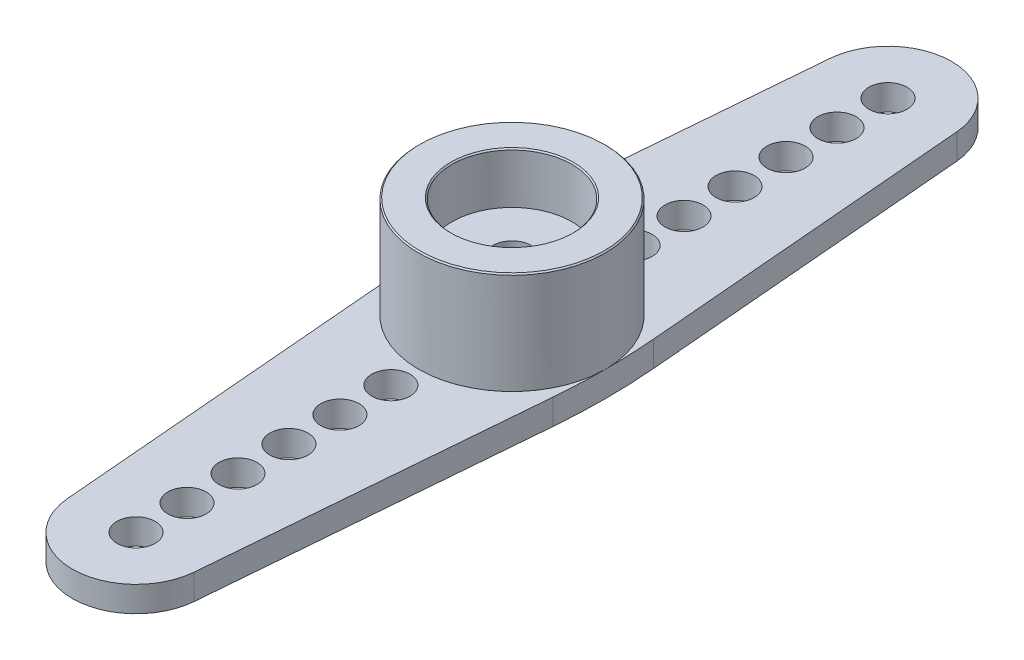
ISO-10303-21;
HEADER;
FILE_DESCRIPTION(('STEP AP214'),'2;1');
FILE_NAME('part.step','',(''),(''),'','','');
FILE_SCHEMA(('AUTOMOTIVE_DESIGN { 1 0 10303 214 1 1 1 1 }'));
ENDSEC;
DATA;
#1=APPLICATION_CONTEXT('core data for automotive mechanical design processes');
#2=APPLICATION_PROTOCOL_DEFINITION('international standard','automotive_design',2000,#1);
#3=PRODUCT_CONTEXT('',#1,'mechanical');
#4=PRODUCT('Part','Part','',(#3));
#5=PRODUCT_RELATED_PRODUCT_CATEGORY('part','',(#4));
#6=PRODUCT_DEFINITION_FORMATION('','',#4);
#7=PRODUCT_DEFINITION_CONTEXT('part definition',#1,'design');
#8=PRODUCT_DEFINITION('design','',#6,#7);
#9=PRODUCT_DEFINITION_SHAPE('','',#8);
#10=(LENGTH_UNIT() NAMED_UNIT(*) SI_UNIT(.MILLI.,.METRE.));
#11=(NAMED_UNIT(*) PLANE_ANGLE_UNIT() SI_UNIT($,.RADIAN.));
#12=(NAMED_UNIT(*) SI_UNIT($,.STERADIAN.) SOLID_ANGLE_UNIT());
#13=UNCERTAINTY_MEASURE_WITH_UNIT(LENGTH_MEASURE(1.E-05),#10,'distance_accuracy_value','');
#14=(GEOMETRIC_REPRESENTATION_CONTEXT(3) GLOBAL_UNCERTAINTY_ASSIGNED_CONTEXT((#13)) GLOBAL_UNIT_ASSIGNED_CONTEXT((#10,
#11,#12)) REPRESENTATION_CONTEXT('',''));
#15=CARTESIAN_POINT('',(0.,0.,0.));
#16=DIRECTION('',(0.,0.,1.));
#17=DIRECTION('',(1.,0.,0.));
#18=AXIS2_PLACEMENT_3D('',#15,#16,#17);
#19=CARTESIAN_POINT('',(0.,1.,0.));
#20=DIRECTION('',(0.,-1.,0.));
#21=DIRECTION('',(0.,0.,-1.));
#22=AXIS2_PLACEMENT_3D('',#19,#20,#21);
#23=CYLINDRICAL_SURFACE('',#22,0.75);
#24=CARTESIAN_POINT('',(0.,0.5,0.));
#25=DIRECTION('',(0.,-1.,0.));
#26=DIRECTION('',(0.,0.,-1.));
#27=AXIS2_PLACEMENT_3D('',#24,#25,#26);
#28=CIRCLE('',#27,0.75);
#29=CARTESIAN_POINT('',(0.,0.5,-0.75));
#30=VERTEX_POINT('',#29);
#31=EDGE_CURVE('E180',#30,#30,#28,.T.);
#32=ORIENTED_EDGE('',*,*,#31,.T.);
#33=EDGE_LOOP('',(#32));
#34=FACE_BOUND('',#33,.T.);
#35=CARTESIAN_POINT('',(0.,3.,0.));
#36=DIRECTION('',(0.,1.,0.));
#37=DIRECTION('',(0.,0.,1.));
#38=AXIS2_PLACEMENT_3D('',#35,#36,#37);
#39=CIRCLE('',#38,0.75);
#40=CARTESIAN_POINT('',(0.,3.,0.75));
#41=VERTEX_POINT('',#40);
#42=EDGE_CURVE('E185',#41,#41,#39,.T.);
#43=ORIENTED_EDGE('',*,*,#42,.T.);
#44=EDGE_LOOP('',(#43));
#45=FACE_BOUND('',#44,.T.);
#46=ADVANCED_FACE('F36',(#34,#45),#23,.F.);
#47=CARTESIAN_POINT('',(0.,1.,-14.75));
#48=DIRECTION('',(0.,-1.,0.));
#49=DIRECTION('',(0.,0.,-1.));
#50=AXIS2_PLACEMENT_3D('',#47,#48,#49);
#51=PLANE('',#50);
#52=CARTESIAN_POINT('',(1.39659253553725E-13,1.,4.75));
#53=DIRECTION('',(0.,1.,0.));
#54=DIRECTION('',(0.,0.,-1.));
#55=AXIS2_PLACEMENT_3D('',#52,#53,#54);
#56=CIRCLE('',#55,0.75);
#57=CARTESIAN_POINT('',(1.39659253553725E-13,1.,4.));
#58=VERTEX_POINT('',#57);
#59=EDGE_CURVE('E376',#58,#58,#56,.T.);
#60=ORIENTED_EDGE('',*,*,#59,.F.);
#61=EDGE_LOOP('',(#60));
#62=FACE_BOUND('',#61,.T.);
#63=CARTESIAN_POINT('',(0.,1.,6.75));
#64=DIRECTION('',(0.,1.,0.));
#65=DIRECTION('',(0.,0.,-1.));
#66=AXIS2_PLACEMENT_3D('',#63,#64,#65);
#67=CIRCLE('',#66,0.75);
#68=CARTESIAN_POINT('',(0.,1.,6.));
#69=VERTEX_POINT('',#68);
#70=EDGE_CURVE('E370',#69,#69,#67,.T.);
#71=ORIENTED_EDGE('',*,*,#70,.F.);
#72=EDGE_LOOP('',(#71));
#73=FACE_BOUND('',#72,.T.);
#74=CARTESIAN_POINT('',(0.,1.,8.75));
#75=DIRECTION('',(0.,1.,0.));
#76=DIRECTION('',(0.,0.,-1.));
#77=AXIS2_PLACEMENT_3D('',#74,#75,#76);
#78=CIRCLE('',#77,0.75);
#79=CARTESIAN_POINT('',(0.,1.,8.));
#80=VERTEX_POINT('',#79);
#81=EDGE_CURVE('E364',#80,#80,#78,.T.);
#82=ORIENTED_EDGE('',*,*,#81,.F.);
#83=EDGE_LOOP('',(#82));
#84=FACE_BOUND('',#83,.T.);
#85=CARTESIAN_POINT('',(0.,1.,10.75));
#86=DIRECTION('',(0.,1.,0.));
#87=DIRECTION('',(0.,0.,-1.));
#88=AXIS2_PLACEMENT_3D('',#85,#86,#87);
#89=CIRCLE('',#88,0.75);
#90=CARTESIAN_POINT('',(0.,1.,10.));
#91=VERTEX_POINT('',#90);
#92=EDGE_CURVE('E358',#91,#91,#89,.T.);
#93=ORIENTED_EDGE('',*,*,#92,.F.);
#94=EDGE_LOOP('',(#93));
#95=FACE_BOUND('',#94,.T.);
#96=CARTESIAN_POINT('',(0.,1.,12.75));
#97=DIRECTION('',(0.,1.,0.));
#98=DIRECTION('',(0.,0.,-1.));
#99=AXIS2_PLACEMENT_3D('',#96,#97,#98);
#100=CIRCLE('',#99,0.75000000000002);
#101=CARTESIAN_POINT('',(0.,1.,12.));
#102=VERTEX_POINT('',#101);
#103=EDGE_CURVE('E352',#102,#102,#100,.T.);
#104=ORIENTED_EDGE('',*,*,#103,.F.);
#105=EDGE_LOOP('',(#104));
#106=FACE_BOUND('',#105,.T.);
#107=CARTESIAN_POINT('',(0.,1.,14.75));
#108=DIRECTION('',(0.,1.,0.));
#109=DIRECTION('',(0.,0.,-1.));
#110=AXIS2_PLACEMENT_3D('',#107,#108,#109);
#111=CIRCLE('',#110,0.75);
#112=CARTESIAN_POINT('',(0.,1.,14.));
#113=VERTEX_POINT('',#112);
#114=EDGE_CURVE('E346',#113,#113,#111,.T.);
#115=ORIENTED_EDGE('',*,*,#114,.F.);
#116=EDGE_LOOP('',(#115));
#117=FACE_BOUND('',#116,.T.);
#118=CARTESIAN_POINT('',(-19.8360523248812,1.,0.));
#119=DIRECTION('',(0.,1.,0.));
#120=DIRECTION('',(0.,0.,1.));
#121=AXIS2_PLACEMENT_3D('',#118,#119,#120);
#122=CIRCLE('',#121,23.5029905467121);
#123=CARTESIAN_POINT('',(3.58416895802137,1.,1.97073582671904));
#124=VERTEX_POINT('',#123);
#125=CARTESIAN_POINT('',(3.66693822183086,1.,0.));
#126=VERTEX_POINT('',#125);
#127=EDGE_CURVE('E122',#124,#126,#122,.T.);
#128=ORIENTED_EDGE('',*,*,#127,.T.);
#129=CARTESIAN_POINT('',(0.,1.,0.));
#130=DIRECTION('',(0.,-1.,0.));
#131=DIRECTION('',(0.,0.,-1.));
#132=AXIS2_PLACEMENT_3D('',#129,#130,#131);
#133=CIRCLE('',#132,3.66693822183086);
#134=CARTESIAN_POINT('',(-3.66693822183086,1.,0.));
#135=VERTEX_POINT('',#134);
#136=EDGE_CURVE('E51',#126,#135,#133,.T.);
#137=ORIENTED_EDGE('',*,*,#136,.T.);
#138=CARTESIAN_POINT('',(19.8360523248812,1.,0.));
#139=DIRECTION('',(0.,1.,0.));
#140=DIRECTION('',(0.,0.,1.));
#141=AXIS2_PLACEMENT_3D('',#138,#139,#140);
#142=CIRCLE('',#141,23.5029905467121);
#143=CARTESIAN_POINT('',(-3.58416895802137,1.,1.97073582671905));
#144=VERTEX_POINT('',#143);
#145=EDGE_CURVE('E306',#135,#144,#142,.T.);
#146=ORIENTED_EDGE('',*,*,#145,.T.);
#147=DIRECTION('',(0.0838504284296131,0.,0.996478351823144));
#148=VECTOR('',#147,1.);
#149=CARTESIAN_POINT('',(-3.58416895802137,1.,1.97073582671904));
#150=LINE('',#149,#148);
#151=CARTESIAN_POINT('',(-2.49119587955786,1.,14.959626071074));
#152=VERTEX_POINT('',#151);
#153=EDGE_CURVE('E307',#144,#152,#150,.T.);
#154=ORIENTED_EDGE('',*,*,#153,.T.);
#155=CARTESIAN_POINT('',(0.,1.,14.75));
#156=DIRECTION('',(0.,1.,0.));
#157=DIRECTION('',(0.,0.,1.));
#158=AXIS2_PLACEMENT_3D('',#155,#156,#157);
#159=CIRCLE('',#158,2.5);
#160=CARTESIAN_POINT('',(2.49119587955786,1.,14.959626071074));
#161=VERTEX_POINT('',#160);
#162=EDGE_CURVE('E124',#152,#161,#159,.T.);
#163=ORIENTED_EDGE('',*,*,#162,.T.);
#164=DIRECTION('',(0.0838504284296132,0.,-0.996478351823144));
#165=VECTOR('',#164,1.);
#166=CARTESIAN_POINT('',(3.58416895802137,1.,1.97073582671904));
#167=LINE('',#166,#165);
#168=EDGE_CURVE('E118',#161,#124,#167,.T.);
#169=ORIENTED_EDGE('',*,*,#168,.T.);
#170=EDGE_LOOP('',(#128,#137,#146,#154,#163,#169));
#171=FACE_BOUND('',#170,.T.);
#172=ADVANCED_FACE('F120',(#62,#73,#84,#95,#106,#117,#171),#51,.F.);
#173=CARTESIAN_POINT('',(-3.58416895802137,1.,-1.97073582671904));
#174=VERTEX_POINT('',#173);
#175=EDGE_CURVE('E305',#174,#135,#142,.T.);
#176=ORIENTED_EDGE('',*,*,#175,.T.);
#177=EDGE_CURVE('E183',#135,#126,#133,.T.);
#178=ORIENTED_EDGE('',*,*,#177,.T.);
#179=CARTESIAN_POINT('',(3.58416895802137,1.,-1.97073582671904));
#180=VERTEX_POINT('',#179);
#181=EDGE_CURVE('E128',#126,#180,#122,.T.);
#182=ORIENTED_EDGE('',*,*,#181,.T.);
#183=DIRECTION('',(-0.0838504284296132,0.,-0.996478351823144));
#184=VECTOR('',#183,1.);
#185=CARTESIAN_POINT('',(2.49119587955786,1.,-14.959626071074));
#186=LINE('',#185,#184);
#187=CARTESIAN_POINT('',(2.49119587955786,1.,-14.959626071074));
#188=VERTEX_POINT('',#187);
#189=EDGE_CURVE('E60',#180,#188,#186,.T.);
#190=ORIENTED_EDGE('',*,*,#189,.T.);
#191=CARTESIAN_POINT('',(0.,1.,-14.75));
#192=DIRECTION('',(0.,1.,0.));
#193=DIRECTION('',(0.,0.,-1.));
#194=AXIS2_PLACEMENT_3D('',#191,#192,#193);
#195=CIRCLE('',#194,2.5);
#196=CARTESIAN_POINT('',(-2.49119587955786,1.,-14.959626071074));
#197=VERTEX_POINT('',#196);
#198=EDGE_CURVE('E164',#188,#197,#195,.T.);
#199=ORIENTED_EDGE('',*,*,#198,.T.);
#200=DIRECTION('',(-0.0838504284296131,0.,0.996478351823144));
#201=VECTOR('',#200,1.);
#202=CARTESIAN_POINT('',(-2.49119587955786,1.,-14.959626071074));
#203=LINE('',#202,#201);
#204=EDGE_CURVE('E102',#197,#174,#203,.T.);
#205=ORIENTED_EDGE('',*,*,#204,.T.);
#206=EDGE_LOOP('',(#176,#178,#182,#190,#199,#205));
#207=FACE_BOUND('',#206,.T.);
#208=CARTESIAN_POINT('',(0.,1.,-14.75));
#209=DIRECTION('',(0.,1.,0.));
#210=DIRECTION('',(0.,0.,1.));
#211=AXIS2_PLACEMENT_3D('',#208,#209,#210);
#212=CIRCLE('',#211,0.75);
#213=CARTESIAN_POINT('',(0.,1.,-14.));
#214=VERTEX_POINT('',#213);
#215=EDGE_CURVE('E152',#214,#214,#212,.T.);
#216=ORIENTED_EDGE('',*,*,#215,.F.);
#217=EDGE_LOOP('',(#216));
#218=FACE_BOUND('',#217,.T.);
#219=CARTESIAN_POINT('',(0.,1.,-12.75));
#220=DIRECTION('',(0.,1.,0.));
#221=DIRECTION('',(0.,0.,1.));
#222=AXIS2_PLACEMENT_3D('',#219,#220,#221);
#223=CIRCLE('',#222,0.75000000000002);
#224=CARTESIAN_POINT('',(0.,1.,-12.));
#225=VERTEX_POINT('',#224);
#226=EDGE_CURVE('E316',#225,#225,#223,.T.);
#227=ORIENTED_EDGE('',*,*,#226,.F.);
#228=EDGE_LOOP('',(#227));
#229=FACE_BOUND('',#228,.T.);
#230=CARTESIAN_POINT('',(0.,1.,-10.75));
#231=DIRECTION('',(0.,1.,0.));
#232=DIRECTION('',(0.,0.,1.));
#233=AXIS2_PLACEMENT_3D('',#230,#231,#232);
#234=CIRCLE('',#233,0.75);
#235=CARTESIAN_POINT('',(0.,1.,-10.));
#236=VERTEX_POINT('',#235);
#237=EDGE_CURVE('E322',#236,#236,#234,.T.);
#238=ORIENTED_EDGE('',*,*,#237,.F.);
#239=EDGE_LOOP('',(#238));
#240=FACE_BOUND('',#239,.T.);
#241=CARTESIAN_POINT('',(0.,1.,-8.75));
#242=DIRECTION('',(0.,1.,0.));
#243=DIRECTION('',(0.,0.,1.));
#244=AXIS2_PLACEMENT_3D('',#241,#242,#243);
#245=CIRCLE('',#244,0.75);
#246=CARTESIAN_POINT('',(0.,1.,-8.));
#247=VERTEX_POINT('',#246);
#248=EDGE_CURVE('E328',#247,#247,#245,.T.);
#249=ORIENTED_EDGE('',*,*,#248,.F.);
#250=EDGE_LOOP('',(#249));
#251=FACE_BOUND('',#250,.T.);
#252=CARTESIAN_POINT('',(0.,1.,-6.75));
#253=DIRECTION('',(0.,1.,0.));
#254=DIRECTION('',(0.,0.,1.));
#255=AXIS2_PLACEMENT_3D('',#252,#253,#254);
#256=CIRCLE('',#255,0.75);
#257=CARTESIAN_POINT('',(0.,1.,-6.));
#258=VERTEX_POINT('',#257);
#259=EDGE_CURVE('E334',#258,#258,#256,.T.);
#260=ORIENTED_EDGE('',*,*,#259,.F.);
#261=EDGE_LOOP('',(#260));
#262=FACE_BOUND('',#261,.T.);
#263=CARTESIAN_POINT('',(1.39659253553725E-13,1.,-4.75));
#264=DIRECTION('',(0.,1.,0.));
#265=DIRECTION('',(0.,0.,1.));
#266=AXIS2_PLACEMENT_3D('',#263,#264,#265);
#267=CIRCLE('',#266,0.75);
#268=CARTESIAN_POINT('',(1.39659253553725E-13,1.,-4.));
#269=VERTEX_POINT('',#268);
#270=EDGE_CURVE('E340',#269,#269,#267,.T.);
#271=ORIENTED_EDGE('',*,*,#270,.F.);
#272=EDGE_LOOP('',(#271));
#273=FACE_BOUND('',#272,.T.);
#274=ADVANCED_FACE('F225',(#207,#218,#229,#240,#251,#262,#273),#51,.F.);
#275=CARTESIAN_POINT('',(0.,0.,-14.75));
#276=DIRECTION('',(0.,-1.,0.));
#277=DIRECTION('',(0.,0.,-1.));
#278=AXIS2_PLACEMENT_3D('',#275,#276,#277);
#279=PLANE('',#278);
#280=CARTESIAN_POINT('',(0.,0.,0.));
#281=DIRECTION('',(0.,-1.,0.));
#282=DIRECTION('',(0.,0.,-1.));
#283=AXIS2_PLACEMENT_3D('',#280,#281,#282);
#284=CIRCLE('',#283,1.5);
#285=CARTESIAN_POINT('',(0.,0.,-1.5));
#286=VERTEX_POINT('',#285);
#287=EDGE_CURVE('E188',#286,#286,#284,.T.);
#288=ORIENTED_EDGE('',*,*,#287,.F.);
#289=EDGE_LOOP('',(#288));
#290=FACE_BOUND('',#289,.T.);
#291=DIRECTION('',(-0.0838504284296132,0.,-0.996478351823144));
#292=VECTOR('',#291,1.);
#293=CARTESIAN_POINT('',(2.49119587955786,0.,-14.959626071074));
#294=LINE('',#293,#292);
#295=CARTESIAN_POINT('',(3.58416895802137,0.,-1.97073582671904));
#296=VERTEX_POINT('',#295);
#297=CARTESIAN_POINT('',(2.49119587955786,0.,-14.959626071074));
#298=VERTEX_POINT('',#297);
#299=EDGE_CURVE('E93',#296,#298,#294,.T.);
#300=ORIENTED_EDGE('',*,*,#299,.F.);
#301=CARTESIAN_POINT('',(-19.8360523248812,0.,0.));
#302=DIRECTION('',(0.,1.,0.));
#303=DIRECTION('',(0.,0.,1.));
#304=AXIS2_PLACEMENT_3D('',#301,#302,#303);
#305=CIRCLE('',#304,23.5029905467121);
#306=CARTESIAN_POINT('',(3.58416895802137,0.,1.97073582671904));
#307=VERTEX_POINT('',#306);
#308=EDGE_CURVE('E161',#307,#296,#305,.T.);
#309=ORIENTED_EDGE('',*,*,#308,.F.);
#310=DIRECTION('',(0.0838504284296132,0.,-0.996478351823144));
#311=VECTOR('',#310,1.);
#312=CARTESIAN_POINT('',(3.58416895802137,0.,1.97073582671904));
#313=LINE('',#312,#311);
#314=CARTESIAN_POINT('',(2.49119587955786,0.,14.959626071074));
#315=VERTEX_POINT('',#314);
#316=EDGE_CURVE('E134',#315,#307,#313,.T.);
#317=ORIENTED_EDGE('',*,*,#316,.F.);
#318=CARTESIAN_POINT('',(0.,0.,14.75));
#319=DIRECTION('',(0.,1.,0.));
#320=DIRECTION('',(0.,0.,1.));
#321=AXIS2_PLACEMENT_3D('',#318,#319,#320);
#322=CIRCLE('',#321,2.5);
#323=CARTESIAN_POINT('',(-2.49119587955786,0.,14.959626071074));
#324=VERTEX_POINT('',#323);
#325=EDGE_CURVE('E158',#324,#315,#322,.T.);
#326=ORIENTED_EDGE('',*,*,#325,.F.);
#327=DIRECTION('',(0.0838504284296131,0.,0.996478351823144));
#328=VECTOR('',#327,1.);
#329=CARTESIAN_POINT('',(-3.58416895802137,0.,1.97073582671904));
#330=LINE('',#329,#328);
#331=CARTESIAN_POINT('',(-3.58416895802137,0.,1.97073582671905));
#332=VERTEX_POINT('',#331);
#333=EDGE_CURVE('E156',#332,#324,#330,.T.);
#334=ORIENTED_EDGE('',*,*,#333,.F.);
#335=CARTESIAN_POINT('',(19.8360523248812,0.,0.));
#336=DIRECTION('',(0.,1.,0.));
#337=DIRECTION('',(0.,0.,1.));
#338=AXIS2_PLACEMENT_3D('',#335,#336,#337);
#339=CIRCLE('',#338,23.5029905467121);
#340=CARTESIAN_POINT('',(-3.58416895802137,0.,-1.97073582671904));
#341=VERTEX_POINT('',#340);
#342=EDGE_CURVE('E154',#341,#332,#339,.T.);
#343=ORIENTED_EDGE('',*,*,#342,.F.);
#344=DIRECTION('',(-0.0838504284296131,0.,0.996478351823144));
#345=VECTOR('',#344,1.);
#346=CARTESIAN_POINT('',(-2.49119587955786,0.,-14.959626071074));
#347=LINE('',#346,#345);
#348=CARTESIAN_POINT('',(-2.49119587955786,0.,-14.959626071074));
#349=VERTEX_POINT('',#348);
#350=EDGE_CURVE('E151',#349,#341,#347,.T.);
#351=ORIENTED_EDGE('',*,*,#350,.F.);
#352=CARTESIAN_POINT('',(0.,0.,-14.75));
#353=DIRECTION('',(0.,1.,0.));
#354=DIRECTION('',(0.,0.,-1.));
#355=AXIS2_PLACEMENT_3D('',#352,#353,#354);
#356=CIRCLE('',#355,2.5);
#357=EDGE_CURVE('E148',#298,#349,#356,.T.);
#358=ORIENTED_EDGE('',*,*,#357,.F.);
#359=EDGE_LOOP('',(#300,#309,#317,#326,#334,#343,#351,#358));
#360=FACE_BOUND('',#359,.T.);
#361=CARTESIAN_POINT('',(1.39659253553725E-13,0.,-4.75));
#362=DIRECTION('',(0.,1.,0.));
#363=DIRECTION('',(0.,0.,1.));
#364=AXIS2_PLACEMENT_3D('',#361,#362,#363);
#365=CIRCLE('',#364,0.75);
#366=CARTESIAN_POINT('',(1.39659253553725E-13,0.,-4.));
#367=VERTEX_POINT('',#366);
#368=EDGE_CURVE('E343',#367,#367,#365,.T.);
#369=ORIENTED_EDGE('',*,*,#368,.T.);
#370=EDGE_LOOP('',(#369));
#371=FACE_BOUND('',#370,.T.);
#372=CARTESIAN_POINT('',(0.,0.,-8.75));
#373=DIRECTION('',(0.,1.,0.));
#374=DIRECTION('',(0.,0.,1.));
#375=AXIS2_PLACEMENT_3D('',#372,#373,#374);
#376=CIRCLE('',#375,0.75);
#377=CARTESIAN_POINT('',(0.,0.,-8.));
#378=VERTEX_POINT('',#377);
#379=EDGE_CURVE('E331',#378,#378,#376,.T.);
#380=ORIENTED_EDGE('',*,*,#379,.T.);
#381=EDGE_LOOP('',(#380));
#382=FACE_BOUND('',#381,.T.);
#383=CARTESIAN_POINT('',(0.,0.,-12.75));
#384=DIRECTION('',(0.,1.,0.));
#385=DIRECTION('',(0.,0.,1.));
#386=AXIS2_PLACEMENT_3D('',#383,#384,#385);
#387=CIRCLE('',#386,0.75000000000002);
#388=CARTESIAN_POINT('',(0.,0.,-12.));
#389=VERTEX_POINT('',#388);
#390=EDGE_CURVE('E319',#389,#389,#387,.T.);
#391=ORIENTED_EDGE('',*,*,#390,.T.);
#392=EDGE_LOOP('',(#391));
#393=FACE_BOUND('',#392,.T.);
#394=CARTESIAN_POINT('',(0.,0.,-14.75));
#395=DIRECTION('',(0.,1.,0.));
#396=DIRECTION('',(0.,0.,1.));
#397=AXIS2_PLACEMENT_3D('',#394,#395,#396);
#398=CIRCLE('',#397,0.75);
#399=CARTESIAN_POINT('',(0.,0.,-14.));
#400=VERTEX_POINT('',#399);
#401=EDGE_CURVE('E313',#400,#400,#398,.T.);
#402=ORIENTED_EDGE('',*,*,#401,.T.);
#403=EDGE_LOOP('',(#402));
#404=FACE_BOUND('',#403,.T.);
#405=CARTESIAN_POINT('',(0.,0.,-10.75));
#406=DIRECTION('',(0.,1.,0.));
#407=DIRECTION('',(0.,0.,1.));
#408=AXIS2_PLACEMENT_3D('',#405,#406,#407);
#409=CIRCLE('',#408,0.75);
#410=CARTESIAN_POINT('',(0.,0.,-10.));
#411=VERTEX_POINT('',#410);
#412=EDGE_CURVE('E325',#411,#411,#409,.T.);
#413=ORIENTED_EDGE('',*,*,#412,.T.);
#414=EDGE_LOOP('',(#413));
#415=FACE_BOUND('',#414,.T.);
#416=CARTESIAN_POINT('',(0.,0.,-6.75));
#417=DIRECTION('',(0.,1.,0.));
#418=DIRECTION('',(0.,0.,1.));
#419=AXIS2_PLACEMENT_3D('',#416,#417,#418);
#420=CIRCLE('',#419,0.75);
#421=CARTESIAN_POINT('',(0.,0.,-6.));
#422=VERTEX_POINT('',#421);
#423=EDGE_CURVE('E337',#422,#422,#420,.T.);
#424=ORIENTED_EDGE('',*,*,#423,.T.);
#425=EDGE_LOOP('',(#424));
#426=FACE_BOUND('',#425,.T.);
#427=CARTESIAN_POINT('',(1.39659253553725E-13,0.,4.75));
#428=DIRECTION('',(0.,1.,0.));
#429=DIRECTION('',(0.,0.,-1.));
#430=AXIS2_PLACEMENT_3D('',#427,#428,#429);
#431=CIRCLE('',#430,0.75);
#432=CARTESIAN_POINT('',(1.39659253553725E-13,0.,4.));
#433=VERTEX_POINT('',#432);
#434=EDGE_CURVE('E379',#433,#433,#431,.T.);
#435=ORIENTED_EDGE('',*,*,#434,.T.);
#436=EDGE_LOOP('',(#435));
#437=FACE_BOUND('',#436,.T.);
#438=CARTESIAN_POINT('',(0.,0.,8.75));
#439=DIRECTION('',(0.,1.,0.));
#440=DIRECTION('',(0.,0.,-1.));
#441=AXIS2_PLACEMENT_3D('',#438,#439,#440);
#442=CIRCLE('',#441,0.75);
#443=CARTESIAN_POINT('',(0.,0.,8.));
#444=VERTEX_POINT('',#443);
#445=EDGE_CURVE('E367',#444,#444,#442,.T.);
#446=ORIENTED_EDGE('',*,*,#445,.T.);
#447=EDGE_LOOP('',(#446));
#448=FACE_BOUND('',#447,.T.);
#449=CARTESIAN_POINT('',(0.,0.,12.75));
#450=DIRECTION('',(0.,1.,0.));
#451=DIRECTION('',(0.,0.,-1.));
#452=AXIS2_PLACEMENT_3D('',#449,#450,#451);
#453=CIRCLE('',#452,0.75000000000002);
#454=CARTESIAN_POINT('',(0.,0.,12.));
#455=VERTEX_POINT('',#454);
#456=EDGE_CURVE('E355',#455,#455,#453,.T.);
#457=ORIENTED_EDGE('',*,*,#456,.T.);
#458=EDGE_LOOP('',(#457));
#459=FACE_BOUND('',#458,.T.);
#460=CARTESIAN_POINT('',(0.,0.,14.75));
#461=DIRECTION('',(0.,1.,0.));
#462=DIRECTION('',(0.,0.,-1.));
#463=AXIS2_PLACEMENT_3D('',#460,#461,#462);
#464=CIRCLE('',#463,0.75);
#465=CARTESIAN_POINT('',(0.,0.,14.));
#466=VERTEX_POINT('',#465);
#467=EDGE_CURVE('E349',#466,#466,#464,.T.);
#468=ORIENTED_EDGE('',*,*,#467,.T.);
#469=EDGE_LOOP('',(#468));
#470=FACE_BOUND('',#469,.T.);
#471=CARTESIAN_POINT('',(0.,0.,10.75));
#472=DIRECTION('',(0.,1.,0.));
#473=DIRECTION('',(0.,0.,-1.));
#474=AXIS2_PLACEMENT_3D('',#471,#472,#473);
#475=CIRCLE('',#474,0.75);
#476=CARTESIAN_POINT('',(0.,0.,10.));
#477=VERTEX_POINT('',#476);
#478=EDGE_CURVE('E361',#477,#477,#475,.T.);
#479=ORIENTED_EDGE('',*,*,#478,.T.);
#480=EDGE_LOOP('',(#479));
#481=FACE_BOUND('',#480,.T.);
#482=CARTESIAN_POINT('',(0.,0.,6.75));
#483=DIRECTION('',(0.,1.,0.));
#484=DIRECTION('',(0.,0.,-1.));
#485=AXIS2_PLACEMENT_3D('',#482,#483,#484);
#486=CIRCLE('',#485,0.75);
#487=CARTESIAN_POINT('',(0.,0.,6.));
#488=VERTEX_POINT('',#487);
#489=EDGE_CURVE('E373',#488,#488,#486,.T.);
#490=ORIENTED_EDGE('',*,*,#489,.T.);
#491=EDGE_LOOP('',(#490));
#492=FACE_BOUND('',#491,.T.);
#493=ADVANCED_FACE('F259',(#290,#360,#371,#382,#393,#404,#415,#426,#437,#448,#459,#470,#481,
#492),#279,.T.);
#494=CARTESIAN_POINT('',(0.,1.,-14.75));
#495=DIRECTION('',(0.,-1.,0.));
#496=DIRECTION('',(0.,0.,-1.));
#497=AXIS2_PLACEMENT_3D('',#494,#495,#496);
#498=CYLINDRICAL_SURFACE('',#497,2.5);
#499=ORIENTED_EDGE('',*,*,#357,.T.);
#500=DIRECTION('',(0.,-1.,0.));
#501=VECTOR('',#500,1.);
#502=CARTESIAN_POINT('',(-2.49119587955786,1.,-14.959626071074));
#503=LINE('',#502,#501);
#504=EDGE_CURVE('E177',#197,#349,#503,.T.);
#505=ORIENTED_EDGE('',*,*,#504,.F.);
#506=ORIENTED_EDGE('',*,*,#198,.F.);
#507=DIRECTION('',(0.,-1.,0.));
#508=VECTOR('',#507,1.);
#509=CARTESIAN_POINT('',(2.49119587955786,1.,-14.959626071074));
#510=LINE('',#509,#508);
#511=EDGE_CURVE('E144',#188,#298,#510,.T.);
#512=ORIENTED_EDGE('',*,*,#511,.T.);
#513=EDGE_LOOP('',(#499,#505,#506,#512));
#514=FACE_BOUND('',#513,.T.);
#515=ADVANCED_FACE('F262',(#514),#498,.T.);
#516=CARTESIAN_POINT('',(-2.49119587955786,1.,-14.959626071074));
#517=DIRECTION('',(0.996478351823144,0.,0.0838504284296132));
#518=DIRECTION('',(0.0838504284296132,0.,-0.996478351823144));
#519=AXIS2_PLACEMENT_3D('',#516,#517,#518);
#520=PLANE('',#519);
#521=ORIENTED_EDGE('',*,*,#350,.T.);
#522=DIRECTION('',(0.,-1.,0.));
#523=VECTOR('',#522,1.);
#524=CARTESIAN_POINT('',(-3.58416895802137,1.,-1.97073582671904));
#525=LINE('',#524,#523);
#526=EDGE_CURVE('E174',#174,#341,#525,.T.);
#527=ORIENTED_EDGE('',*,*,#526,.F.);
#528=ORIENTED_EDGE('',*,*,#204,.F.);
#529=ORIENTED_EDGE('',*,*,#504,.T.);
#530=EDGE_LOOP('',(#521,#527,#528,#529));
#531=FACE_BOUND('',#530,.T.);
#532=ADVANCED_FACE('F281',(#531),#520,.F.);
#533=CARTESIAN_POINT('',(19.8360523248812,1.,0.));
#534=DIRECTION('',(0.,-1.,0.));
#535=DIRECTION('',(0.,0.,-1.));
#536=AXIS2_PLACEMENT_3D('',#533,#534,#535);
#537=CYLINDRICAL_SURFACE('',#536,23.5029905467121);
#538=ORIENTED_EDGE('',*,*,#145,.F.);
#539=ORIENTED_EDGE('',*,*,#175,.F.);
#540=ORIENTED_EDGE('',*,*,#526,.T.);
#541=ORIENTED_EDGE('',*,*,#342,.T.);
#542=DIRECTION('',(0.,-1.,0.));
#543=VECTOR('',#542,1.);
#544=CARTESIAN_POINT('',(-3.58416895802137,1.,1.97073582671905));
#545=LINE('',#544,#543);
#546=EDGE_CURVE('E171',#144,#332,#545,.T.);
#547=ORIENTED_EDGE('',*,*,#546,.F.);
#548=EDGE_LOOP('',(#538,#539,#540,#541,#547));
#549=FACE_BOUND('',#548,.T.);
#550=ADVANCED_FACE('F277',(#549),#537,.T.);
#551=CARTESIAN_POINT('',(-3.58416895802137,1.,1.97073582671904));
#552=DIRECTION('',(0.996478351823144,0.,-0.0838504284296132));
#553=DIRECTION('',(-0.0838504284296132,0.,-0.996478351823144));
#554=AXIS2_PLACEMENT_3D('',#551,#552,#553);
#555=PLANE('',#554);
#556=ORIENTED_EDGE('',*,*,#333,.T.);
#557=DIRECTION('',(0.,-1.,0.));
#558=VECTOR('',#557,1.);
#559=CARTESIAN_POINT('',(-2.49119587955786,1.,14.959626071074));
#560=LINE('',#559,#558);
#561=EDGE_CURVE('E168',#152,#324,#560,.T.);
#562=ORIENTED_EDGE('',*,*,#561,.F.);
#563=ORIENTED_EDGE('',*,*,#153,.F.);
#564=ORIENTED_EDGE('',*,*,#546,.T.);
#565=EDGE_LOOP('',(#556,#562,#563,#564));
#566=FACE_BOUND('',#565,.T.);
#567=ADVANCED_FACE('F273',(#566),#555,.F.);
#568=CARTESIAN_POINT('',(0.,1.,14.75));
#569=DIRECTION('',(0.,-1.,0.));
#570=DIRECTION('',(0.,0.,-1.));
#571=AXIS2_PLACEMENT_3D('',#568,#569,#570);
#572=CYLINDRICAL_SURFACE('',#571,2.5);
#573=ORIENTED_EDGE('',*,*,#325,.T.);
#574=DIRECTION('',(0.,-1.,0.));
#575=VECTOR('',#574,1.);
#576=CARTESIAN_POINT('',(2.49119587955786,1.,14.959626071074));
#577=LINE('',#576,#575);
#578=EDGE_CURVE('E137',#161,#315,#577,.T.);
#579=ORIENTED_EDGE('',*,*,#578,.F.);
#580=ORIENTED_EDGE('',*,*,#162,.F.);
#581=ORIENTED_EDGE('',*,*,#561,.T.);
#582=EDGE_LOOP('',(#573,#579,#580,#581));
#583=FACE_BOUND('',#582,.T.);
#584=ADVANCED_FACE('F270',(#583),#572,.T.);
#585=CARTESIAN_POINT('',(3.58416895802137,1.,1.97073582671904));
#586=DIRECTION('',(-0.996478351823144,0.,-0.0838504284296132));
#587=DIRECTION('',(-0.0838504284296132,0.,0.996478351823144));
#588=AXIS2_PLACEMENT_3D('',#585,#586,#587);
#589=PLANE('',#588);
#590=ORIENTED_EDGE('',*,*,#316,.T.);
#591=DIRECTION('',(0.,-1.,0.));
#592=VECTOR('',#591,1.);
#593=CARTESIAN_POINT('',(3.58416895802137,1.,1.97073582671904));
#594=LINE('',#593,#592);
#595=EDGE_CURVE('E131',#124,#307,#594,.T.);
#596=ORIENTED_EDGE('',*,*,#595,.F.);
#597=ORIENTED_EDGE('',*,*,#168,.F.);
#598=ORIENTED_EDGE('',*,*,#578,.T.);
#599=EDGE_LOOP('',(#590,#596,#597,#598));
#600=FACE_BOUND('',#599,.T.);
#601=ADVANCED_FACE('F132',(#600),#589,.F.);
#602=CARTESIAN_POINT('',(-19.8360523248812,1.,0.));
#603=DIRECTION('',(0.,-1.,0.));
#604=DIRECTION('',(0.,0.,-1.));
#605=AXIS2_PLACEMENT_3D('',#602,#603,#604);
#606=CYLINDRICAL_SURFACE('',#605,23.5029905467121);
#607=ORIENTED_EDGE('',*,*,#181,.F.);
#608=ORIENTED_EDGE('',*,*,#127,.F.);
#609=ORIENTED_EDGE('',*,*,#595,.T.);
#610=ORIENTED_EDGE('',*,*,#308,.T.);
#611=DIRECTION('',(0.,-1.,0.));
#612=VECTOR('',#611,1.);
#613=CARTESIAN_POINT('',(3.58416895802137,1.,-1.97073582671904));
#614=LINE('',#613,#612);
#615=EDGE_CURVE('E138',#180,#296,#614,.T.);
#616=ORIENTED_EDGE('',*,*,#615,.F.);
#617=EDGE_LOOP('',(#607,#608,#609,#610,#616));
#618=FACE_BOUND('',#617,.T.);
#619=ADVANCED_FACE('F141',(#618),#606,.T.);
#620=CARTESIAN_POINT('',(2.49119587955786,1.,-14.959626071074));
#621=DIRECTION('',(-0.996478351823144,0.,0.0838504284296132));
#622=DIRECTION('',(0.0838504284296132,0.,0.996478351823144));
#623=AXIS2_PLACEMENT_3D('',#620,#621,#622);
#624=PLANE('',#623);
#625=ORIENTED_EDGE('',*,*,#299,.T.);
#626=ORIENTED_EDGE('',*,*,#511,.F.);
#627=ORIENTED_EDGE('',*,*,#189,.F.);
#628=ORIENTED_EDGE('',*,*,#615,.T.);
#629=EDGE_LOOP('',(#625,#626,#627,#628));
#630=FACE_BOUND('',#629,.T.);
#631=ADVANCED_FACE('F255',(#630),#624,.F.);
#632=CARTESIAN_POINT('',(0.,1.,-14.75));
#633=DIRECTION('',(0.,-1.,0.));
#634=DIRECTION('',(0.,0.,-1.));
#635=AXIS2_PLACEMENT_3D('',#632,#633,#634);
#636=CYLINDRICAL_SURFACE('',#635,0.75);
#637=ORIENTED_EDGE('',*,*,#215,.T.);
#638=EDGE_LOOP('',(#637));
#639=FACE_BOUND('',#638,.T.);
#640=ORIENTED_EDGE('',*,*,#401,.F.);
#641=EDGE_LOOP('',(#640));
#642=FACE_BOUND('',#641,.T.);
#643=ADVANCED_FACE('F252',(#639,#642),#636,.F.);
#644=CARTESIAN_POINT('',(0.,1.,-12.75));
#645=DIRECTION('',(0.,-1.,0.));
#646=DIRECTION('',(0.,0.,-1.));
#647=AXIS2_PLACEMENT_3D('',#644,#645,#646);
#648=CYLINDRICAL_SURFACE('',#647,0.75000000000002);
#649=ORIENTED_EDGE('',*,*,#226,.T.);
#650=EDGE_LOOP('',(#649));
#651=FACE_BOUND('',#650,.T.);
#652=ORIENTED_EDGE('',*,*,#390,.F.);
#653=EDGE_LOOP('',(#652));
#654=FACE_BOUND('',#653,.T.);
#655=ADVANCED_FACE('F248',(#651,#654),#648,.F.);
#656=CARTESIAN_POINT('',(0.,1.,-10.75));
#657=DIRECTION('',(0.,-1.,0.));
#658=DIRECTION('',(0.,0.,-1.));
#659=AXIS2_PLACEMENT_3D('',#656,#657,#658);
#660=CYLINDRICAL_SURFACE('',#659,0.75);
#661=ORIENTED_EDGE('',*,*,#237,.T.);
#662=EDGE_LOOP('',(#661));
#663=FACE_BOUND('',#662,.T.);
#664=ORIENTED_EDGE('',*,*,#412,.F.);
#665=EDGE_LOOP('',(#664));
#666=FACE_BOUND('',#665,.T.);
#667=ADVANCED_FACE('F244',(#663,#666),#660,.F.);
#668=CARTESIAN_POINT('',(0.,1.,-8.75));
#669=DIRECTION('',(0.,-1.,0.));
#670=DIRECTION('',(0.,0.,-1.));
#671=AXIS2_PLACEMENT_3D('',#668,#669,#670);
#672=CYLINDRICAL_SURFACE('',#671,0.75);
#673=ORIENTED_EDGE('',*,*,#248,.T.);
#674=EDGE_LOOP('',(#673));
#675=FACE_BOUND('',#674,.T.);
#676=ORIENTED_EDGE('',*,*,#379,.F.);
#677=EDGE_LOOP('',(#676));
#678=FACE_BOUND('',#677,.T.);
#679=ADVANCED_FACE('F240',(#675,#678),#672,.F.);
#680=CARTESIAN_POINT('',(0.,1.,-6.75));
#681=DIRECTION('',(0.,-1.,0.));
#682=DIRECTION('',(0.,0.,-1.));
#683=AXIS2_PLACEMENT_3D('',#680,#681,#682);
#684=CYLINDRICAL_SURFACE('',#683,0.75);
#685=ORIENTED_EDGE('',*,*,#259,.T.);
#686=EDGE_LOOP('',(#685));
#687=FACE_BOUND('',#686,.T.);
#688=ORIENTED_EDGE('',*,*,#423,.F.);
#689=EDGE_LOOP('',(#688));
#690=FACE_BOUND('',#689,.T.);
#691=ADVANCED_FACE('F236',(#687,#690),#684,.F.);
#692=CARTESIAN_POINT('',(1.39659253553725E-13,1.,-4.75));
#693=DIRECTION('',(0.,-1.,0.));
#694=DIRECTION('',(0.,0.,-1.));
#695=AXIS2_PLACEMENT_3D('',#692,#693,#694);
#696=CYLINDRICAL_SURFACE('',#695,0.75);
#697=ORIENTED_EDGE('',*,*,#270,.T.);
#698=EDGE_LOOP('',(#697));
#699=FACE_BOUND('',#698,.T.);
#700=ORIENTED_EDGE('',*,*,#368,.F.);
#701=EDGE_LOOP('',(#700));
#702=FACE_BOUND('',#701,.T.);
#703=ADVANCED_FACE('F233',(#699,#702),#696,.F.);
#704=CARTESIAN_POINT('',(0.,1.,14.75));
#705=DIRECTION('',(0.,-1.,0.));
#706=DIRECTION('',(0.,0.,-1.));
#707=AXIS2_PLACEMENT_3D('',#704,#705,#706);
#708=CYLINDRICAL_SURFACE('',#707,0.75);
#709=ORIENTED_EDGE('',*,*,#114,.T.);
#710=EDGE_LOOP('',(#709));
#711=FACE_BOUND('',#710,.T.);
#712=ORIENTED_EDGE('',*,*,#467,.F.);
#713=EDGE_LOOP('',(#712));
#714=FACE_BOUND('',#713,.T.);
#715=ADVANCED_FACE('F231',(#711,#714),#708,.F.);
#716=CARTESIAN_POINT('',(0.,1.,12.75));
#717=DIRECTION('',(0.,-1.,0.));
#718=DIRECTION('',(0.,0.,-1.));
#719=AXIS2_PLACEMENT_3D('',#716,#717,#718);
#720=CYLINDRICAL_SURFACE('',#719,0.75000000000002);
#721=ORIENTED_EDGE('',*,*,#103,.T.);
#722=EDGE_LOOP('',(#721));
#723=FACE_BOUND('',#722,.T.);
#724=ORIENTED_EDGE('',*,*,#456,.F.);
#725=EDGE_LOOP('',(#724));
#726=FACE_BOUND('',#725,.T.);
#727=ADVANCED_FACE('F506',(#723,#726),#720,.F.);
#728=CARTESIAN_POINT('',(0.,1.,10.75));
#729=DIRECTION('',(0.,-1.,0.));
#730=DIRECTION('',(0.,0.,-1.));
#731=AXIS2_PLACEMENT_3D('',#728,#729,#730);
#732=CYLINDRICAL_SURFACE('',#731,0.75);
#733=ORIENTED_EDGE('',*,*,#92,.T.);
#734=EDGE_LOOP('',(#733));
#735=FACE_BOUND('',#734,.T.);
#736=ORIENTED_EDGE('',*,*,#478,.F.);
#737=EDGE_LOOP('',(#736));
#738=FACE_BOUND('',#737,.T.);
#739=ADVANCED_FACE('F497',(#735,#738),#732,.F.);
#740=CARTESIAN_POINT('',(0.,1.,8.75));
#741=DIRECTION('',(0.,-1.,0.));
#742=DIRECTION('',(0.,0.,-1.));
#743=AXIS2_PLACEMENT_3D('',#740,#741,#742);
#744=CYLINDRICAL_SURFACE('',#743,0.75);
#745=ORIENTED_EDGE('',*,*,#81,.T.);
#746=EDGE_LOOP('',(#745));
#747=FACE_BOUND('',#746,.T.);
#748=ORIENTED_EDGE('',*,*,#445,.F.);
#749=EDGE_LOOP('',(#748));
#750=FACE_BOUND('',#749,.T.);
#751=ADVANCED_FACE('F488',(#747,#750),#744,.F.);
#752=CARTESIAN_POINT('',(0.,1.,6.75));
#753=DIRECTION('',(0.,-1.,0.));
#754=DIRECTION('',(0.,0.,-1.));
#755=AXIS2_PLACEMENT_3D('',#752,#753,#754);
#756=CYLINDRICAL_SURFACE('',#755,0.75);
#757=ORIENTED_EDGE('',*,*,#70,.T.);
#758=EDGE_LOOP('',(#757));
#759=FACE_BOUND('',#758,.T.);
#760=ORIENTED_EDGE('',*,*,#489,.F.);
#761=EDGE_LOOP('',(#760));
#762=FACE_BOUND('',#761,.T.);
#763=ADVANCED_FACE('F216',(#759,#762),#756,.F.);
#764=CARTESIAN_POINT('',(1.39659253553725E-13,1.,4.75));
#765=DIRECTION('',(0.,-1.,0.));
#766=DIRECTION('',(0.,0.,-1.));
#767=AXIS2_PLACEMENT_3D('',#764,#765,#766);
#768=CYLINDRICAL_SURFACE('',#767,0.75);
#769=ORIENTED_EDGE('',*,*,#59,.T.);
#770=EDGE_LOOP('',(#769));
#771=FACE_BOUND('',#770,.T.);
#772=ORIENTED_EDGE('',*,*,#434,.F.);
#773=EDGE_LOOP('',(#772));
#774=FACE_BOUND('',#773,.T.);
#775=ADVANCED_FACE('F208',(#771,#774),#768,.F.);
#776=CARTESIAN_POINT('',(0.,5.,0.));
#777=DIRECTION('',(0.,-1.,0.));
#778=DIRECTION('',(0.,0.,-1.));
#779=AXIS2_PLACEMENT_3D('',#776,#777,#778);
#780=CYLINDRICAL_SURFACE('',#779,3.66693822183086);
#781=CARTESIAN_POINT('',(0.,4.95,0.));
#782=DIRECTION('',(0.,-1.,0.));
#783=DIRECTION('',(0.,0.,-1.));
#784=AXIS2_PLACEMENT_3D('',#781,#782,#783);
#785=CIRCLE('',#784,3.66693822183086);
#786=CARTESIAN_POINT('',(0.,4.95,-3.66693822183086));
#787=VERTEX_POINT('',#786);
#788=EDGE_CURVE('E179',#787,#787,#785,.T.);
#789=ORIENTED_EDGE('',*,*,#788,.T.);
#790=EDGE_LOOP('',(#789));
#791=FACE_BOUND('',#790,.T.);
#792=ORIENTED_EDGE('',*,*,#136,.F.);
#793=ORIENTED_EDGE('',*,*,#177,.F.);
#794=EDGE_LOOP('',(#792,#793));
#795=FACE_BOUND('',#794,.T.);
#796=ADVANCED_FACE('F206',(#791,#795),#780,.T.);
#797=CARTESIAN_POINT('',(0.,5.,0.));
#798=DIRECTION('',(0.,-1.,0.));
#799=DIRECTION('',(0.,0.,-1.));
#800=AXIS2_PLACEMENT_3D('',#797,#798,#799);
#801=PLANE('',#800);
#802=CARTESIAN_POINT('',(0.,5.,0.));
#803=DIRECTION('',(0.,-1.,0.));
#804=DIRECTION('',(0.,0.,-1.));
#805=AXIS2_PLACEMENT_3D('',#802,#803,#804);
#806=CIRCLE('',#805,3.61693822183086);
#807=CARTESIAN_POINT('',(0.,5.,-3.61693822183086));
#808=VERTEX_POINT('',#807);
#809=EDGE_CURVE('E45',#808,#808,#806,.F.);
#810=ORIENTED_EDGE('',*,*,#809,.T.);
#811=EDGE_LOOP('',(#810));
#812=FACE_BOUND('',#811,.T.);
#813=CARTESIAN_POINT('',(0.,5.,0.));
#814=DIRECTION('',(0.,-1.,0.));
#815=DIRECTION('',(0.,0.,-1.));
#816=AXIS2_PLACEMENT_3D('',#813,#814,#815);
#817=CIRCLE('',#816,2.405);
#818=CARTESIAN_POINT('',(0.,5.,-2.405));
#819=VERTEX_POINT('',#818);
#820=EDGE_CURVE('E192',#819,#819,#817,.T.);
#821=ORIENTED_EDGE('',*,*,#820,.T.);
#822=EDGE_LOOP('',(#821));
#823=FACE_BOUND('',#822,.T.);
#824=ADVANCED_FACE('F197',(#812,#823),#801,.F.);
#825=CARTESIAN_POINT('',(0.,0.5,0.));
#826=DIRECTION('',(0.,-1.,0.));
#827=DIRECTION('',(0.,0.,-1.));
#828=AXIS2_PLACEMENT_3D('',#825,#826,#827);
#829=CYLINDRICAL_SURFACE('',#828,1.5);
#830=CARTESIAN_POINT('',(0.,0.5,0.));
#831=DIRECTION('',(0.,-1.,0.));
#832=DIRECTION('',(0.,0.,-1.));
#833=AXIS2_PLACEMENT_3D('',#830,#831,#832);
#834=CIRCLE('',#833,1.5);
#835=CARTESIAN_POINT('',(0.,0.5,-1.5));
#836=VERTEX_POINT('',#835);
#837=EDGE_CURVE('E184',#836,#836,#834,.T.);
#838=ORIENTED_EDGE('',*,*,#837,.F.);
#839=EDGE_LOOP('',(#838));
#840=FACE_BOUND('',#839,.T.);
#841=ORIENTED_EDGE('',*,*,#287,.T.);
#842=EDGE_LOOP('',(#841));
#843=FACE_BOUND('',#842,.T.);
#844=ADVANCED_FACE('F214',(#840,#843),#829,.F.);
#845=CARTESIAN_POINT('',(0.,0.5,0.));
#846=DIRECTION('',(0.,-1.,0.));
#847=DIRECTION('',(0.,0.,-1.));
#848=AXIS2_PLACEMENT_3D('',#845,#846,#847);
#849=PLANE('',#848);
#850=ORIENTED_EDGE('',*,*,#31,.F.);
#851=EDGE_LOOP('',(#850));
#852=FACE_BOUND('',#851,.T.);
#853=ORIENTED_EDGE('',*,*,#837,.T.);
#854=EDGE_LOOP('',(#853));
#855=FACE_BOUND('',#854,.T.);
#856=ADVANCED_FACE('F395',(#852,#855),#849,.T.);
#857=CARTESIAN_POINT('',(0.,3.,0.));
#858=DIRECTION('',(0.,1.,0.));
#859=DIRECTION('',(0.,0.,1.));
#860=AXIS2_PLACEMENT_3D('',#857,#858,#859);
#861=CYLINDRICAL_SURFACE('',#860,2.355);
#862=CARTESIAN_POINT('',(0.,4.95,0.));
#863=DIRECTION('',(0.,-1.,0.));
#864=DIRECTION('',(0.,0.,-1.));
#865=AXIS2_PLACEMENT_3D('',#862,#863,#864);
#866=CIRCLE('',#865,2.355);
#867=CARTESIAN_POINT('',(0.,4.95,-2.355));
#868=VERTEX_POINT('',#867);
#869=EDGE_CURVE('E11',#868,#868,#866,.F.);
#870=ORIENTED_EDGE('',*,*,#869,.T.);
#871=EDGE_LOOP('',(#870));
#872=FACE_BOUND('',#871,.T.);
#873=CARTESIAN_POINT('',(0.,3.,0.));
#874=DIRECTION('',(0.,1.,0.));
#875=DIRECTION('',(0.,0.,1.));
#876=AXIS2_PLACEMENT_3D('',#873,#874,#875);
#877=CIRCLE('',#876,2.355);
#878=CARTESIAN_POINT('',(0.,3.,2.355));
#879=VERTEX_POINT('',#878);
#880=EDGE_CURVE('E189',#879,#879,#877,.T.);
#881=ORIENTED_EDGE('',*,*,#880,.F.);
#882=EDGE_LOOP('',(#881));
#883=FACE_BOUND('',#882,.T.);
#884=ADVANCED_FACE('F393',(#872,#883),#861,.F.);
#885=CARTESIAN_POINT('',(0.,3.,0.));
#886=DIRECTION('',(0.,1.,0.));
#887=DIRECTION('',(0.,0.,1.));
#888=AXIS2_PLACEMENT_3D('',#885,#886,#887);
#889=PLANE('',#888);
#890=ORIENTED_EDGE('',*,*,#42,.F.);
#891=EDGE_LOOP('',(#890));
#892=FACE_BOUND('',#891,.T.);
#893=ORIENTED_EDGE('',*,*,#880,.T.);
#894=EDGE_LOOP('',(#893));
#895=FACE_BOUND('',#894,.T.);
#896=ADVANCED_FACE('F203',(#892,#895),#889,.T.);
#897=CARTESIAN_POINT('',(0.,4.95,0.));
#898=DIRECTION('',(0.,-1.,0.));
#899=DIRECTION('',(0.,0.,-1.));
#900=AXIS2_PLACEMENT_3D('',#897,#898,#899);
#901=CONICAL_SURFACE('',#900,3.66693822183086,0.785398163397461);
#902=ORIENTED_EDGE('',*,*,#809,.F.);
#903=EDGE_LOOP('',(#902));
#904=FACE_BOUND('',#903,.T.);
#905=ORIENTED_EDGE('',*,*,#788,.F.);
#906=EDGE_LOOP('',(#905));
#907=FACE_BOUND('',#906,.T.);
#908=ADVANCED_FACE('F200',(#904,#907),#901,.T.);
#909=CARTESIAN_POINT('',(0.,4.95,0.));
#910=DIRECTION('',(0.,1.,0.));
#911=DIRECTION('',(0.,0.,1.));
#912=AXIS2_PLACEMENT_3D('',#909,#910,#911);
#913=CONICAL_SURFACE('',#912,2.355,0.785398163397461);
#914=ORIENTED_EDGE('',*,*,#820,.F.);
#915=EDGE_LOOP('',(#914));
#916=FACE_BOUND('',#915,.T.);
#917=ORIENTED_EDGE('',*,*,#869,.F.);
#918=EDGE_LOOP('',(#917));
#919=FACE_BOUND('',#918,.T.);
#920=ADVANCED_FACE('F39',(#916,#919),#913,.F.);
#921=CLOSED_SHELL('',(#46,#172,#274,#493,#515,#532,#550,#567,#584,#601,#619,#631,#643,#655,#667,
#679,#691,#703,#715,#727,#739,#751,#763,#775,#796,#824,#844,#856,#884,#896,#908,#920));
#922=MANIFOLD_SOLID_BREP('B2',#921);
#923=ADVANCED_BREP_SHAPE_REPRESENTATION('',(#18,#922),#14);
#924=SHAPE_DEFINITION_REPRESENTATION(#9,#923);
ENDSEC;
END-ISO-10303-21;
